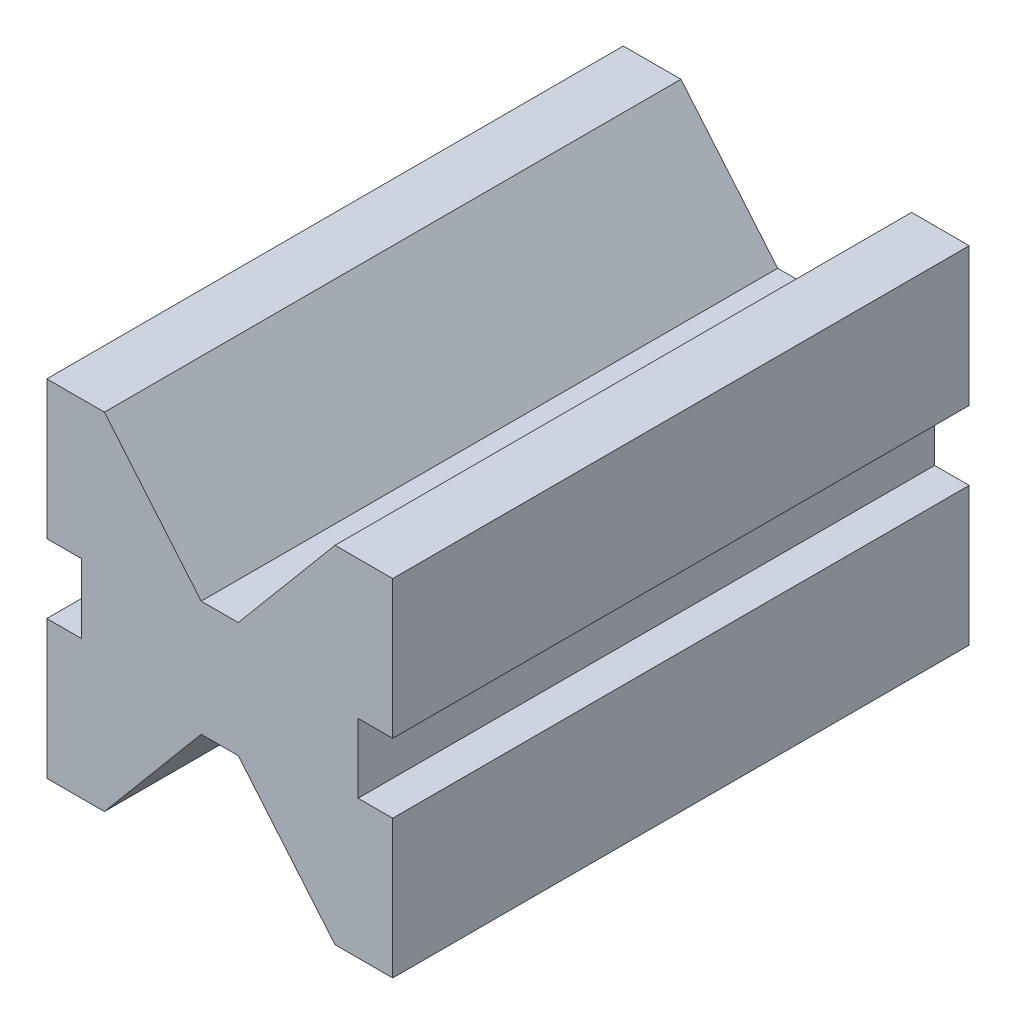
ISO-10303-21;
HEADER;
FILE_DESCRIPTION(('STEP AP214'),'2;1');
FILE_NAME('part.step','',(''),(''),'','','');
FILE_SCHEMA(('AUTOMOTIVE_DESIGN { 1 0 10303 214 1 1 1 1 }'));
ENDSEC;
DATA;
#1=APPLICATION_CONTEXT('core data for automotive mechanical design processes');
#2=APPLICATION_PROTOCOL_DEFINITION('international standard','automotive_design',2000,#1);
#3=PRODUCT_CONTEXT('',#1,'mechanical');
#4=PRODUCT('Part','Part','',(#3));
#5=PRODUCT_RELATED_PRODUCT_CATEGORY('part','',(#4));
#6=PRODUCT_DEFINITION_FORMATION('','',#4);
#7=PRODUCT_DEFINITION_CONTEXT('part definition',#1,'design');
#8=PRODUCT_DEFINITION('design','',#6,#7);
#9=PRODUCT_DEFINITION_SHAPE('','',#8);
#10=(LENGTH_UNIT() NAMED_UNIT(*) SI_UNIT(.MILLI.,.METRE.));
#11=(NAMED_UNIT(*) PLANE_ANGLE_UNIT() SI_UNIT($,.RADIAN.));
#12=(NAMED_UNIT(*) SI_UNIT($,.STERADIAN.) SOLID_ANGLE_UNIT());
#13=UNCERTAINTY_MEASURE_WITH_UNIT(LENGTH_MEASURE(1.E-05),#10,'distance_accuracy_value','');
#14=(GEOMETRIC_REPRESENTATION_CONTEXT(3) GLOBAL_UNCERTAINTY_ASSIGNED_CONTEXT((#13)) GLOBAL_UNIT_ASSIGNED_CONTEXT((#10,
#11,#12)) REPRESENTATION_CONTEXT('',''));
#15=CARTESIAN_POINT('',(0.,0.,0.));
#16=DIRECTION('',(0.,0.,1.));
#17=DIRECTION('',(1.,0.,0.));
#18=AXIS2_PLACEMENT_3D('',#15,#16,#17);
#19=CARTESIAN_POINT('',(0.,0.,-100.));
#20=DIRECTION('',(-1.,0.,0.));
#21=DIRECTION('',(0.,0.,1.));
#22=AXIS2_PLACEMENT_3D('',#19,#20,#21);
#23=PLANE('',#22);
#24=DIRECTION('',(0.,0.,1.));
#25=VECTOR('',#24,1.);
#26=CARTESIAN_POINT('',(-1.73472347597681E-13,24.,-100.));
#27=LINE('',#26,#25);
#28=CARTESIAN_POINT('',(-1.73472347597681E-13,24.,-100.));
#29=VERTEX_POINT('',#28);
#30=CARTESIAN_POINT('',(-1.73472347597681E-13,24.,0.));
#31=VERTEX_POINT('',#30);
#32=EDGE_CURVE('E202',#29,#31,#27,.T.);
#33=ORIENTED_EDGE('',*,*,#32,.F.);
#34=DIRECTION('',(0.,-1.,0.));
#35=VECTOR('',#34,1.);
#36=CARTESIAN_POINT('',(0.,0.,-100.));
#37=LINE('',#36,#35);
#38=CARTESIAN_POINT('',(0.,0.,-100.));
#39=VERTEX_POINT('',#38);
#40=EDGE_CURVE('E193',#29,#39,#37,.T.);
#41=ORIENTED_EDGE('',*,*,#40,.T.);
#42=DIRECTION('',(0.,0.,1.));
#43=VECTOR('',#42,1.);
#44=CARTESIAN_POINT('',(0.,0.,-100.));
#45=LINE('',#44,#43);
#46=CARTESIAN_POINT('',(0.,0.,0.));
#47=VERTEX_POINT('',#46);
#48=EDGE_CURVE('E38',#39,#47,#45,.T.);
#49=ORIENTED_EDGE('',*,*,#48,.T.);
#50=DIRECTION('',(0.,-1.,0.));
#51=VECTOR('',#50,1.);
#52=CARTESIAN_POINT('',(0.,0.,0.));
#53=LINE('',#52,#51);
#54=EDGE_CURVE('E279',#31,#47,#53,.T.);
#55=ORIENTED_EDGE('',*,*,#54,.F.);
#56=EDGE_LOOP('',(#33,#41,#49,#55));
#57=FACE_BOUND('',#56,.T.);
#58=ADVANCED_FACE('F34',(#57),#23,.T.);
#59=CARTESIAN_POINT('',(60.,0.,-100.));
#60=DIRECTION('',(1.,0.,0.));
#61=DIRECTION('',(0.,0.,-1.));
#62=AXIS2_PLACEMENT_3D('',#59,#60,#61);
#63=PLANE('',#62);
#64=DIRECTION('',(0.,0.,1.));
#65=VECTOR('',#64,1.);
#66=CARTESIAN_POINT('',(60.,24.,-100.));
#67=LINE('',#66,#65);
#68=CARTESIAN_POINT('',(60.,24.,-100.));
#69=VERTEX_POINT('',#68);
#70=CARTESIAN_POINT('',(60.,24.,0.));
#71=VERTEX_POINT('',#70);
#72=EDGE_CURVE('E219',#69,#71,#67,.T.);
#73=ORIENTED_EDGE('',*,*,#72,.T.);
#74=DIRECTION('',(0.,1.,0.));
#75=VECTOR('',#74,1.);
#76=CARTESIAN_POINT('',(60.,0.,0.));
#77=LINE('',#76,#75);
#78=CARTESIAN_POINT('',(60.,0.,0.));
#79=VERTEX_POINT('',#78);
#80=EDGE_CURVE('E308',#79,#71,#77,.T.);
#81=ORIENTED_EDGE('',*,*,#80,.F.);
#82=DIRECTION('',(0.,0.,1.));
#83=VECTOR('',#82,1.);
#84=CARTESIAN_POINT('',(60.,0.,-100.));
#85=LINE('',#84,#83);
#86=CARTESIAN_POINT('',(60.,0.,-100.));
#87=VERTEX_POINT('',#86);
#88=EDGE_CURVE('E316',#87,#79,#85,.T.);
#89=ORIENTED_EDGE('',*,*,#88,.F.);
#90=DIRECTION('',(0.,1.,0.));
#91=VECTOR('',#90,1.);
#92=CARTESIAN_POINT('',(60.,0.,-100.));
#93=LINE('',#92,#91);
#94=EDGE_CURVE('E293',#87,#69,#93,.T.);
#95=ORIENTED_EDGE('',*,*,#94,.T.);
#96=EDGE_LOOP('',(#73,#81,#89,#95));
#97=FACE_BOUND('',#96,.T.);
#98=ADVANCED_FACE('F376',(#97),#63,.T.);
#99=CARTESIAN_POINT('',(0.,60.,-100.));
#100=DIRECTION('',(0.,1.,0.));
#101=DIRECTION('',(0.,0.,1.));
#102=AXIS2_PLACEMENT_3D('',#99,#100,#101);
#103=PLANE('',#102);
#104=DIRECTION('',(0.,0.,1.));
#105=VECTOR('',#104,1.);
#106=CARTESIAN_POINT('',(10.,60.,-100.));
#107=LINE('',#106,#105);
#108=CARTESIAN_POINT('',(10.,60.,-100.));
#109=VERTEX_POINT('',#108);
#110=CARTESIAN_POINT('',(10.,60.,0.));
#111=VERTEX_POINT('',#110);
#112=EDGE_CURVE('E249',#109,#111,#107,.T.);
#113=ORIENTED_EDGE('',*,*,#112,.F.);
#114=DIRECTION('',(-1.,0.,0.));
#115=VECTOR('',#114,1.);
#116=CARTESIAN_POINT('',(0.,60.,-100.));
#117=LINE('',#116,#115);
#118=CARTESIAN_POINT('',(0.,60.,-100.));
#119=VERTEX_POINT('',#118);
#120=EDGE_CURVE('E296',#109,#119,#117,.T.);
#121=ORIENTED_EDGE('',*,*,#120,.T.);
#122=DIRECTION('',(0.,0.,1.));
#123=VECTOR('',#122,1.);
#124=CARTESIAN_POINT('',(0.,60.,-100.));
#125=LINE('',#124,#123);
#126=CARTESIAN_POINT('',(0.,60.,0.));
#127=VERTEX_POINT('',#126);
#128=EDGE_CURVE('E11',#119,#127,#125,.T.);
#129=ORIENTED_EDGE('',*,*,#128,.T.);
#130=DIRECTION('',(-1.,0.,0.));
#131=VECTOR('',#130,1.);
#132=CARTESIAN_POINT('',(0.,60.,0.));
#133=LINE('',#132,#131);
#134=EDGE_CURVE('E311',#111,#127,#133,.T.);
#135=ORIENTED_EDGE('',*,*,#134,.F.);
#136=EDGE_LOOP('',(#113,#121,#129,#135));
#137=FACE_BOUND('',#136,.T.);
#138=ADVANCED_FACE('F343',(#137),#103,.T.);
#139=CARTESIAN_POINT('',(0.,0.,-100.));
#140=DIRECTION('',(0.,-1.,0.));
#141=DIRECTION('',(0.,0.,-1.));
#142=AXIS2_PLACEMENT_3D('',#139,#140,#141);
#143=PLANE('',#142);
#144=DIRECTION('',(0.,0.,1.));
#145=VECTOR('',#144,1.);
#146=CARTESIAN_POINT('',(10.,0.,-100.));
#147=LINE('',#146,#145);
#148=CARTESIAN_POINT('',(10.,0.,-100.));
#149=VERTEX_POINT('',#148);
#150=CARTESIAN_POINT('',(10.,0.,0.));
#151=VERTEX_POINT('',#150);
#152=EDGE_CURVE('E276',#149,#151,#147,.T.);
#153=ORIENTED_EDGE('',*,*,#152,.T.);
#154=DIRECTION('',(1.,0.,0.));
#155=VECTOR('',#154,1.);
#156=CARTESIAN_POINT('',(0.,0.,0.));
#157=LINE('',#156,#155);
#158=EDGE_CURVE('E304',#47,#151,#157,.T.);
#159=ORIENTED_EDGE('',*,*,#158,.F.);
#160=ORIENTED_EDGE('',*,*,#48,.F.);
#161=DIRECTION('',(1.,0.,0.));
#162=VECTOR('',#161,1.);
#163=CARTESIAN_POINT('',(0.,0.,-100.));
#164=LINE('',#163,#162);
#165=EDGE_CURVE('E289',#39,#149,#164,.T.);
#166=ORIENTED_EDGE('',*,*,#165,.T.);
#167=EDGE_LOOP('',(#153,#159,#160,#166));
#168=FACE_BOUND('',#167,.T.);
#169=ADVANCED_FACE('F328',(#168),#143,.T.);
#170=DIRECTION('',(0.,0.,1.));
#171=VECTOR('',#170,1.);
#172=CARTESIAN_POINT('',(-2.56739074444567E-13,36.,-100.));
#173=LINE('',#172,#171);
#174=CARTESIAN_POINT('',(-2.56739074444567E-13,36.,-100.));
#175=VERTEX_POINT('',#174);
#176=CARTESIAN_POINT('',(-2.56739074444567E-13,36.,0.));
#177=VERTEX_POINT('',#176);
#178=EDGE_CURVE('E205',#175,#177,#173,.T.);
#179=ORIENTED_EDGE('',*,*,#178,.T.);
#180=EDGE_CURVE('E300',#127,#177,#53,.T.);
#181=ORIENTED_EDGE('',*,*,#180,.F.);
#182=ORIENTED_EDGE('',*,*,#128,.F.);
#183=EDGE_CURVE('E285',#119,#175,#37,.T.);
#184=ORIENTED_EDGE('',*,*,#183,.T.);
#185=EDGE_LOOP('',(#179,#181,#182,#184));
#186=FACE_BOUND('',#185,.T.);
#187=ADVANCED_FACE('F36',(#186),#23,.T.);
#188=DIRECTION('',(0.,0.,1.));
#189=VECTOR('',#188,1.);
#190=CARTESIAN_POINT('',(50.,60.,-100.));
#191=LINE('',#190,#189);
#192=CARTESIAN_POINT('',(50.,60.,-100.));
#193=VERTEX_POINT('',#192);
#194=CARTESIAN_POINT('',(50.,60.,0.));
#195=VERTEX_POINT('',#194);
#196=EDGE_CURVE('E252',#193,#195,#191,.T.);
#197=ORIENTED_EDGE('',*,*,#196,.T.);
#198=CARTESIAN_POINT('',(60.,60.,0.));
#199=VERTEX_POINT('',#198);
#200=EDGE_CURVE('E312',#199,#195,#133,.T.);
#201=ORIENTED_EDGE('',*,*,#200,.F.);
#202=DIRECTION('',(0.,0.,1.));
#203=VECTOR('',#202,1.);
#204=CARTESIAN_POINT('',(60.,60.,-100.));
#205=LINE('',#204,#203);
#206=CARTESIAN_POINT('',(60.,60.,-100.));
#207=VERTEX_POINT('',#206);
#208=EDGE_CURVE('E43',#207,#199,#205,.T.);
#209=ORIENTED_EDGE('',*,*,#208,.F.);
#210=EDGE_CURVE('E297',#207,#193,#117,.T.);
#211=ORIENTED_EDGE('',*,*,#210,.T.);
#212=EDGE_LOOP('',(#197,#201,#209,#211));
#213=FACE_BOUND('',#212,.T.);
#214=ADVANCED_FACE('F359',(#213),#103,.T.);
#215=DIRECTION('',(0.,0.,1.));
#216=VECTOR('',#215,1.);
#217=CARTESIAN_POINT('',(60.,36.,-100.));
#218=LINE('',#217,#216);
#219=CARTESIAN_POINT('',(60.,36.,-100.));
#220=VERTEX_POINT('',#219);
#221=CARTESIAN_POINT('',(60.,36.,0.));
#222=VERTEX_POINT('',#221);
#223=EDGE_CURVE('E59',#220,#222,#218,.T.);
#224=ORIENTED_EDGE('',*,*,#223,.F.);
#225=EDGE_CURVE('E292',#220,#207,#93,.T.);
#226=ORIENTED_EDGE('',*,*,#225,.T.);
#227=ORIENTED_EDGE('',*,*,#208,.T.);
#228=EDGE_CURVE('E307',#222,#199,#77,.T.);
#229=ORIENTED_EDGE('',*,*,#228,.F.);
#230=EDGE_LOOP('',(#224,#226,#227,#229));
#231=FACE_BOUND('',#230,.T.);
#232=ADVANCED_FACE('F363',(#231),#63,.T.);
#233=DIRECTION('',(0.,0.,1.));
#234=VECTOR('',#233,1.);
#235=CARTESIAN_POINT('',(50.,0.,-100.));
#236=LINE('',#235,#234);
#237=CARTESIAN_POINT('',(50.,0.,-100.));
#238=VERTEX_POINT('',#237);
#239=CARTESIAN_POINT('',(50.,0.,0.));
#240=VERTEX_POINT('',#239);
#241=EDGE_CURVE('E269',#238,#240,#236,.T.);
#242=ORIENTED_EDGE('',*,*,#241,.F.);
#243=EDGE_CURVE('E288',#238,#87,#164,.T.);
#244=ORIENTED_EDGE('',*,*,#243,.T.);
#245=ORIENTED_EDGE('',*,*,#88,.T.);
#246=EDGE_CURVE('E303',#240,#79,#157,.T.);
#247=ORIENTED_EDGE('',*,*,#246,.F.);
#248=EDGE_LOOP('',(#242,#244,#245,#247));
#249=FACE_BOUND('',#248,.T.);
#250=ADVANCED_FACE('F379',(#249),#143,.T.);
#251=CARTESIAN_POINT('',(0.,0.,-100.));
#252=DIRECTION('',(0.,0.,-1.));
#253=DIRECTION('',(-1.,0.,0.));
#254=AXIS2_PLACEMENT_3D('',#251,#252,#253);
#255=PLANE('',#254);
#256=DIRECTION('',(1.,0.,0.));
#257=VECTOR('',#256,1.);
#258=CARTESIAN_POINT('',(5.99999999999983,24.,-100.));
#259=LINE('',#258,#257);
#260=CARTESIAN_POINT('',(5.99999999999983,24.,-100.));
#261=VERTEX_POINT('',#260);
#262=EDGE_CURVE('E175',#29,#261,#259,.T.);
#263=ORIENTED_EDGE('',*,*,#262,.T.);
#264=DIRECTION('',(0.,1.,0.));
#265=VECTOR('',#264,1.);
#266=CARTESIAN_POINT('',(5.99999999999975,36.,-100.));
#267=LINE('',#266,#265);
#268=CARTESIAN_POINT('',(5.99999999999975,36.,-100.));
#269=VERTEX_POINT('',#268);
#270=EDGE_CURVE('E184',#261,#269,#267,.T.);
#271=ORIENTED_EDGE('',*,*,#270,.T.);
#272=DIRECTION('',(-1.,0.,0.));
#273=VECTOR('',#272,1.);
#274=CARTESIAN_POINT('',(-2.56739074444567E-13,36.,-100.));
#275=LINE('',#274,#273);
#276=EDGE_CURVE('E181',#269,#175,#275,.T.);
#277=ORIENTED_EDGE('',*,*,#276,.T.);
#278=ORIENTED_EDGE('',*,*,#183,.F.);
#279=ORIENTED_EDGE('',*,*,#120,.F.);
#280=DIRECTION('',(0.642787609686538,-0.766044443118979,0.));
#281=VECTOR('',#280,1.);
#282=CARTESIAN_POINT('',(10.,60.,-100.));
#283=LINE('',#282,#281);
#284=CARTESIAN_POINT('',(26.7819926235455,40.,-100.));
#285=VERTEX_POINT('',#284);
#286=EDGE_CURVE('E233',#109,#285,#283,.T.);
#287=ORIENTED_EDGE('',*,*,#286,.T.);
#288=DIRECTION('',(1.,0.,0.));
#289=VECTOR('',#288,1.);
#290=CARTESIAN_POINT('',(26.7819926235455,40.,-100.));
#291=LINE('',#290,#289);
#292=CARTESIAN_POINT('',(33.2180073764543,40.,-100.));
#293=VERTEX_POINT('',#292);
#294=EDGE_CURVE('E236',#285,#293,#291,.T.);
#295=ORIENTED_EDGE('',*,*,#294,.T.);
#296=DIRECTION('',(0.642787609686541,0.766044443118976,0.));
#297=VECTOR('',#296,1.);
#298=CARTESIAN_POINT('',(50.,60.,-100.));
#299=LINE('',#298,#297);
#300=EDGE_CURVE('E240',#293,#193,#299,.T.);
#301=ORIENTED_EDGE('',*,*,#300,.T.);
#302=ORIENTED_EDGE('',*,*,#210,.F.);
#303=ORIENTED_EDGE('',*,*,#225,.F.);
#304=DIRECTION('',(-1.,0.,0.));
#305=VECTOR('',#304,1.);
#306=CARTESIAN_POINT('',(60.,36.,-100.));
#307=LINE('',#306,#305);
#308=CARTESIAN_POINT('',(54.,36.,-100.));
#309=VERTEX_POINT('',#308);
#310=EDGE_CURVE('E212',#220,#309,#307,.T.);
#311=ORIENTED_EDGE('',*,*,#310,.T.);
#312=DIRECTION('',(0.,-1.,0.));
#313=VECTOR('',#312,1.);
#314=CARTESIAN_POINT('',(54.,36.,-100.));
#315=LINE('',#314,#313);
#316=CARTESIAN_POINT('',(54.,24.,-100.));
#317=VERTEX_POINT('',#316);
#318=EDGE_CURVE('E216',#309,#317,#315,.T.);
#319=ORIENTED_EDGE('',*,*,#318,.T.);
#320=DIRECTION('',(1.,0.,0.));
#321=VECTOR('',#320,1.);
#322=CARTESIAN_POINT('',(54.,24.,-100.));
#323=LINE('',#322,#321);
#324=EDGE_CURVE('E209',#317,#69,#323,.T.);
#325=ORIENTED_EDGE('',*,*,#324,.T.);
#326=ORIENTED_EDGE('',*,*,#94,.F.);
#327=ORIENTED_EDGE('',*,*,#243,.F.);
#328=DIRECTION('',(-0.642787609686541,0.766044443118976,0.));
#329=VECTOR('',#328,1.);
#330=CARTESIAN_POINT('',(50.,0.,-100.));
#331=LINE('',#330,#329);
#332=CARTESIAN_POINT('',(33.2180073764543,20.,-100.));
#333=VERTEX_POINT('',#332);
#334=EDGE_CURVE('E259',#238,#333,#331,.T.);
#335=ORIENTED_EDGE('',*,*,#334,.T.);
#336=DIRECTION('',(-1.,0.,0.));
#337=VECTOR('',#336,1.);
#338=CARTESIAN_POINT('',(26.7819926235455,20.,-100.));
#339=LINE('',#338,#337);
#340=CARTESIAN_POINT('',(26.7819926235455,20.,-100.));
#341=VERTEX_POINT('',#340);
#342=EDGE_CURVE('E262',#333,#341,#339,.T.);
#343=ORIENTED_EDGE('',*,*,#342,.T.);
#344=DIRECTION('',(-0.642787609686538,-0.766044443118979,0.));
#345=VECTOR('',#344,1.);
#346=CARTESIAN_POINT('',(10.,0.,-100.));
#347=LINE('',#346,#345);
#348=EDGE_CURVE('E266',#341,#149,#347,.T.);
#349=ORIENTED_EDGE('',*,*,#348,.T.);
#350=ORIENTED_EDGE('',*,*,#165,.F.);
#351=ORIENTED_EDGE('',*,*,#40,.F.);
#352=EDGE_LOOP('',(#263,#271,#277,#278,#279,#287,#295,#301,#302,#303,#311,#319,#325,#326,#327,
#335,#343,#349,#350,#351));
#353=FACE_BOUND('',#352,.T.);
#354=ADVANCED_FACE('F191',(#353),#255,.T.);
#355=CARTESIAN_POINT('',(0.,0.,0.));
#356=DIRECTION('',(0.,0.,-1.));
#357=DIRECTION('',(-1.,0.,0.));
#358=AXIS2_PLACEMENT_3D('',#355,#356,#357);
#359=PLANE('',#358);
#360=DIRECTION('',(0.,1.,0.));
#361=VECTOR('',#360,1.);
#362=CARTESIAN_POINT('',(5.99999999999975,36.,0.));
#363=LINE('',#362,#361);
#364=CARTESIAN_POINT('',(5.99999999999983,24.,0.));
#365=VERTEX_POINT('',#364);
#366=CARTESIAN_POINT('',(5.99999999999975,36.,0.));
#367=VERTEX_POINT('',#366);
#368=EDGE_CURVE('E196',#365,#367,#363,.T.);
#369=ORIENTED_EDGE('',*,*,#368,.F.);
#370=DIRECTION('',(1.,0.,0.));
#371=VECTOR('',#370,1.);
#372=CARTESIAN_POINT('',(5.99999999999983,24.,0.));
#373=LINE('',#372,#371);
#374=EDGE_CURVE('E51',#31,#365,#373,.T.);
#375=ORIENTED_EDGE('',*,*,#374,.F.);
#376=ORIENTED_EDGE('',*,*,#54,.T.);
#377=ORIENTED_EDGE('',*,*,#158,.T.);
#378=DIRECTION('',(-0.642787609686538,-0.766044443118979,0.));
#379=VECTOR('',#378,1.);
#380=CARTESIAN_POINT('',(10.,0.,0.));
#381=LINE('',#380,#379);
#382=CARTESIAN_POINT('',(26.7819926235455,20.,0.));
#383=VERTEX_POINT('',#382);
#384=EDGE_CURVE('E263',#383,#151,#381,.T.);
#385=ORIENTED_EDGE('',*,*,#384,.F.);
#386=DIRECTION('',(-1.,0.,0.));
#387=VECTOR('',#386,1.);
#388=CARTESIAN_POINT('',(26.7819926235455,20.,0.));
#389=LINE('',#388,#387);
#390=CARTESIAN_POINT('',(33.2180073764543,20.,0.));
#391=VERTEX_POINT('',#390);
#392=EDGE_CURVE('E272',#391,#383,#389,.T.);
#393=ORIENTED_EDGE('',*,*,#392,.F.);
#394=DIRECTION('',(-0.642787609686541,0.766044443118976,0.));
#395=VECTOR('',#394,1.);
#396=CARTESIAN_POINT('',(50.,0.,0.));
#397=LINE('',#396,#395);
#398=EDGE_CURVE('E251',#240,#391,#397,.T.);
#399=ORIENTED_EDGE('',*,*,#398,.F.);
#400=ORIENTED_EDGE('',*,*,#246,.T.);
#401=ORIENTED_EDGE('',*,*,#80,.T.);
#402=DIRECTION('',(1.,0.,0.));
#403=VECTOR('',#402,1.);
#404=CARTESIAN_POINT('',(54.,24.,0.));
#405=LINE('',#404,#403);
#406=CARTESIAN_POINT('',(54.,24.,0.));
#407=VERTEX_POINT('',#406);
#408=EDGE_CURVE('E204',#407,#71,#405,.T.);
#409=ORIENTED_EDGE('',*,*,#408,.F.);
#410=DIRECTION('',(0.,-1.,0.));
#411=VECTOR('',#410,1.);
#412=CARTESIAN_POINT('',(54.,36.,0.));
#413=LINE('',#412,#411);
#414=CARTESIAN_POINT('',(54.,36.,0.));
#415=VERTEX_POINT('',#414);
#416=EDGE_CURVE('E213',#415,#407,#413,.T.);
#417=ORIENTED_EDGE('',*,*,#416,.F.);
#418=DIRECTION('',(-1.,0.,0.));
#419=VECTOR('',#418,1.);
#420=CARTESIAN_POINT('',(60.,36.,0.));
#421=LINE('',#420,#419);
#422=EDGE_CURVE('E221',#222,#415,#421,.T.);
#423=ORIENTED_EDGE('',*,*,#422,.F.);
#424=ORIENTED_EDGE('',*,*,#228,.T.);
#425=ORIENTED_EDGE('',*,*,#200,.T.);
#426=DIRECTION('',(0.642787609686541,0.766044443118976,0.));
#427=VECTOR('',#426,1.);
#428=CARTESIAN_POINT('',(50.,60.,0.));
#429=LINE('',#428,#427);
#430=CARTESIAN_POINT('',(33.2180073764543,40.,0.));
#431=VERTEX_POINT('',#430);
#432=EDGE_CURVE('E237',#431,#195,#429,.T.);
#433=ORIENTED_EDGE('',*,*,#432,.F.);
#434=DIRECTION('',(1.,0.,0.));
#435=VECTOR('',#434,1.);
#436=CARTESIAN_POINT('',(26.7819926235455,40.,0.));
#437=LINE('',#436,#435);
#438=CARTESIAN_POINT('',(26.7819926235455,40.,0.));
#439=VERTEX_POINT('',#438);
#440=EDGE_CURVE('E245',#439,#431,#437,.T.);
#441=ORIENTED_EDGE('',*,*,#440,.F.);
#442=DIRECTION('',(0.642787609686538,-0.766044443118979,0.));
#443=VECTOR('',#442,1.);
#444=CARTESIAN_POINT('',(10.,60.,0.));
#445=LINE('',#444,#443);
#446=EDGE_CURVE('E227',#111,#439,#445,.T.);
#447=ORIENTED_EDGE('',*,*,#446,.F.);
#448=ORIENTED_EDGE('',*,*,#134,.T.);
#449=ORIENTED_EDGE('',*,*,#180,.T.);
#450=DIRECTION('',(-1.,0.,0.));
#451=VECTOR('',#450,1.);
#452=CARTESIAN_POINT('',(-2.56739074444567E-13,36.,0.));
#453=LINE('',#452,#451);
#454=EDGE_CURVE('E194',#367,#177,#453,.T.);
#455=ORIENTED_EDGE('',*,*,#454,.F.);
#456=EDGE_LOOP('',(#369,#375,#376,#377,#385,#393,#399,#400,#401,#409,#417,#423,#424,#425,#433,
#441,#447,#448,#449,#455));
#457=FACE_BOUND('',#456,.T.);
#458=ADVANCED_FACE('F331',(#457),#359,.F.);
#459=CARTESIAN_POINT('',(10.,0.,-100.));
#460=DIRECTION('',(-0.766044443118979,0.642787609686538,0.));
#461=DIRECTION('',(-0.642787609686538,-0.766044443118979,0.));
#462=AXIS2_PLACEMENT_3D('',#459,#460,#461);
#463=PLANE('',#462);
#464=ORIENTED_EDGE('',*,*,#384,.T.);
#465=ORIENTED_EDGE('',*,*,#152,.F.);
#466=ORIENTED_EDGE('',*,*,#348,.F.);
#467=DIRECTION('',(0.,0.,1.));
#468=VECTOR('',#467,1.);
#469=CARTESIAN_POINT('',(26.7819926235455,20.,-100.));
#470=LINE('',#469,#468);
#471=EDGE_CURVE('E280',#341,#383,#470,.T.);
#472=ORIENTED_EDGE('',*,*,#471,.T.);
#473=EDGE_LOOP('',(#464,#465,#466,#472));
#474=FACE_BOUND('',#473,.T.);
#475=ADVANCED_FACE('F387',(#474),#463,.F.);
#476=CARTESIAN_POINT('',(26.7819926235455,20.,-100.));
#477=DIRECTION('',(0.,1.,0.));
#478=DIRECTION('',(0.,0.,1.));
#479=AXIS2_PLACEMENT_3D('',#476,#477,#478);
#480=PLANE('',#479);
#481=ORIENTED_EDGE('',*,*,#392,.T.);
#482=ORIENTED_EDGE('',*,*,#471,.F.);
#483=ORIENTED_EDGE('',*,*,#342,.F.);
#484=DIRECTION('',(0.,0.,1.));
#485=VECTOR('',#484,1.);
#486=CARTESIAN_POINT('',(33.2180073764543,20.,-100.));
#487=LINE('',#486,#485);
#488=EDGE_CURVE('E282',#333,#391,#487,.T.);
#489=ORIENTED_EDGE('',*,*,#488,.T.);
#490=EDGE_LOOP('',(#481,#482,#483,#489));
#491=FACE_BOUND('',#490,.T.);
#492=ADVANCED_FACE('F384',(#491),#480,.F.);
#493=CARTESIAN_POINT('',(50.,0.,-100.));
#494=DIRECTION('',(0.766044443118976,0.642787609686541,0.));
#495=DIRECTION('',(-0.642787609686541,0.766044443118976,0.));
#496=AXIS2_PLACEMENT_3D('',#493,#494,#495);
#497=PLANE('',#496);
#498=ORIENTED_EDGE('',*,*,#398,.T.);
#499=ORIENTED_EDGE('',*,*,#488,.F.);
#500=ORIENTED_EDGE('',*,*,#334,.F.);
#501=ORIENTED_EDGE('',*,*,#241,.T.);
#502=EDGE_LOOP('',(#498,#499,#500,#501));
#503=FACE_BOUND('',#502,.T.);
#504=ADVANCED_FACE('F382',(#503),#497,.F.);
#505=CARTESIAN_POINT('',(10.,60.,-100.));
#506=DIRECTION('',(-0.766044443118979,-0.642787609686538,0.));
#507=DIRECTION('',(0.642787609686538,-0.766044443118979,0.));
#508=AXIS2_PLACEMENT_3D('',#505,#506,#507);
#509=PLANE('',#508);
#510=ORIENTED_EDGE('',*,*,#446,.T.);
#511=DIRECTION('',(0.,0.,1.));
#512=VECTOR('',#511,1.);
#513=CARTESIAN_POINT('',(26.7819926235455,40.,-100.));
#514=LINE('',#513,#512);
#515=EDGE_CURVE('E243',#285,#439,#514,.T.);
#516=ORIENTED_EDGE('',*,*,#515,.F.);
#517=ORIENTED_EDGE('',*,*,#286,.F.);
#518=ORIENTED_EDGE('',*,*,#112,.T.);
#519=EDGE_LOOP('',(#510,#516,#517,#518));
#520=FACE_BOUND('',#519,.T.);
#521=ADVANCED_FACE('F347',(#520),#509,.F.);
#522=CARTESIAN_POINT('',(50.,60.,-100.));
#523=DIRECTION('',(0.766044443118976,-0.642787609686541,0.));
#524=DIRECTION('',(0.642787609686541,0.766044443118976,0.));
#525=AXIS2_PLACEMENT_3D('',#522,#523,#524);
#526=PLANE('',#525);
#527=ORIENTED_EDGE('',*,*,#432,.T.);
#528=ORIENTED_EDGE('',*,*,#196,.F.);
#529=ORIENTED_EDGE('',*,*,#300,.F.);
#530=DIRECTION('',(0.,0.,1.));
#531=VECTOR('',#530,1.);
#532=CARTESIAN_POINT('',(33.2180073764543,40.,-100.));
#533=LINE('',#532,#531);
#534=EDGE_CURVE('E255',#293,#431,#533,.T.);
#535=ORIENTED_EDGE('',*,*,#534,.T.);
#536=EDGE_LOOP('',(#527,#528,#529,#535));
#537=FACE_BOUND('',#536,.T.);
#538=ADVANCED_FACE('F424',(#537),#526,.F.);
#539=CARTESIAN_POINT('',(26.7819926235455,40.,-100.));
#540=DIRECTION('',(0.,-1.,0.));
#541=DIRECTION('',(0.,0.,-1.));
#542=AXIS2_PLACEMENT_3D('',#539,#540,#541);
#543=PLANE('',#542);
#544=ORIENTED_EDGE('',*,*,#440,.T.);
#545=ORIENTED_EDGE('',*,*,#534,.F.);
#546=ORIENTED_EDGE('',*,*,#294,.F.);
#547=ORIENTED_EDGE('',*,*,#515,.T.);
#548=EDGE_LOOP('',(#544,#545,#546,#547));
#549=FACE_BOUND('',#548,.T.);
#550=ADVANCED_FACE('F351',(#549),#543,.F.);
#551=CARTESIAN_POINT('',(54.,24.,-100.));
#552=DIRECTION('',(0.,-1.,0.));
#553=DIRECTION('',(1.,0.,0.));
#554=AXIS2_PLACEMENT_3D('',#551,#552,#553);
#555=PLANE('',#554);
#556=ORIENTED_EDGE('',*,*,#408,.T.);
#557=ORIENTED_EDGE('',*,*,#72,.F.);
#558=ORIENTED_EDGE('',*,*,#324,.F.);
#559=DIRECTION('',(0.,0.,1.));
#560=VECTOR('',#559,1.);
#561=CARTESIAN_POINT('',(54.,24.,-100.));
#562=LINE('',#561,#560);
#563=EDGE_CURVE('E225',#317,#407,#562,.T.);
#564=ORIENTED_EDGE('',*,*,#563,.T.);
#565=EDGE_LOOP('',(#556,#557,#558,#564));
#566=FACE_BOUND('',#565,.T.);
#567=ADVANCED_FACE('F372',(#566),#555,.F.);
#568=CARTESIAN_POINT('',(54.,36.,-100.));
#569=DIRECTION('',(-1.,0.,0.));
#570=DIRECTION('',(0.,-1.,0.));
#571=AXIS2_PLACEMENT_3D('',#568,#569,#570);
#572=PLANE('',#571);
#573=ORIENTED_EDGE('',*,*,#416,.T.);
#574=ORIENTED_EDGE('',*,*,#563,.F.);
#575=ORIENTED_EDGE('',*,*,#318,.F.);
#576=DIRECTION('',(0.,0.,1.));
#577=VECTOR('',#576,1.);
#578=CARTESIAN_POINT('',(54.,36.,-100.));
#579=LINE('',#578,#577);
#580=EDGE_CURVE('E228',#309,#415,#579,.T.);
#581=ORIENTED_EDGE('',*,*,#580,.T.);
#582=EDGE_LOOP('',(#573,#574,#575,#581));
#583=FACE_BOUND('',#582,.T.);
#584=ADVANCED_FACE('F368',(#583),#572,.F.);
#585=CARTESIAN_POINT('',(60.,36.,-100.));
#586=DIRECTION('',(0.,1.,0.));
#587=DIRECTION('',(0.,0.,1.));
#588=AXIS2_PLACEMENT_3D('',#585,#586,#587);
#589=PLANE('',#588);
#590=ORIENTED_EDGE('',*,*,#422,.T.);
#591=ORIENTED_EDGE('',*,*,#580,.F.);
#592=ORIENTED_EDGE('',*,*,#310,.F.);
#593=ORIENTED_EDGE('',*,*,#223,.T.);
#594=EDGE_LOOP('',(#590,#591,#592,#593));
#595=FACE_BOUND('',#594,.T.);
#596=ADVANCED_FACE('F365',(#595),#589,.F.);
#597=CARTESIAN_POINT('',(5.99999999999983,24.,-100.));
#598=DIRECTION('',(0.,-1.,0.));
#599=DIRECTION('',(1.,0.,0.));
#600=AXIS2_PLACEMENT_3D('',#597,#598,#599);
#601=PLANE('',#600);
#602=ORIENTED_EDGE('',*,*,#374,.T.);
#603=DIRECTION('',(0.,0.,1.));
#604=VECTOR('',#603,1.);
#605=CARTESIAN_POINT('',(5.99999999999983,24.,-100.));
#606=LINE('',#605,#604);
#607=EDGE_CURVE('E171',#261,#365,#606,.T.);
#608=ORIENTED_EDGE('',*,*,#607,.F.);
#609=ORIENTED_EDGE('',*,*,#262,.F.);
#610=ORIENTED_EDGE('',*,*,#32,.T.);
#611=EDGE_LOOP('',(#602,#608,#609,#610));
#612=FACE_BOUND('',#611,.T.);
#613=ADVANCED_FACE('F173',(#612),#601,.F.);
#614=CARTESIAN_POINT('',(-2.56739074444567E-13,36.,-100.));
#615=DIRECTION('',(0.,1.,0.));
#616=DIRECTION('',(0.,0.,1.));
#617=AXIS2_PLACEMENT_3D('',#614,#615,#616);
#618=PLANE('',#617);
#619=ORIENTED_EDGE('',*,*,#454,.T.);
#620=ORIENTED_EDGE('',*,*,#178,.F.);
#621=ORIENTED_EDGE('',*,*,#276,.F.);
#622=DIRECTION('',(0.,0.,1.));
#623=VECTOR('',#622,1.);
#624=CARTESIAN_POINT('',(5.99999999999975,36.,-100.));
#625=LINE('',#624,#623);
#626=EDGE_CURVE('E180',#269,#367,#625,.T.);
#627=ORIENTED_EDGE('',*,*,#626,.T.);
#628=EDGE_LOOP('',(#619,#620,#621,#627));
#629=FACE_BOUND('',#628,.T.);
#630=ADVANCED_FACE('F336',(#629),#618,.F.);
#631=CARTESIAN_POINT('',(5.99999999999975,36.,-100.));
#632=DIRECTION('',(1.,0.,0.));
#633=DIRECTION('',(0.,1.,0.));
#634=AXIS2_PLACEMENT_3D('',#631,#632,#633);
#635=PLANE('',#634);
#636=ORIENTED_EDGE('',*,*,#368,.T.);
#637=ORIENTED_EDGE('',*,*,#626,.F.);
#638=ORIENTED_EDGE('',*,*,#270,.F.);
#639=ORIENTED_EDGE('',*,*,#607,.T.);
#640=EDGE_LOOP('',(#636,#637,#638,#639));
#641=FACE_BOUND('',#640,.T.);
#642=ADVANCED_FACE('F185',(#641),#635,.F.);
#643=CLOSED_SHELL('',(#58,#98,#138,#169,#187,#214,#232,#250,#354,#458,#475,#492,#504,#521,#538,
#550,#567,#584,#596,#613,#630,#642));
#644=MANIFOLD_SOLID_BREP('B2',#643);
#645=ADVANCED_BREP_SHAPE_REPRESENTATION('',(#18,#644),#14);
#646=SHAPE_DEFINITION_REPRESENTATION(#9,#645);
ENDSEC;
END-ISO-10303-21;
